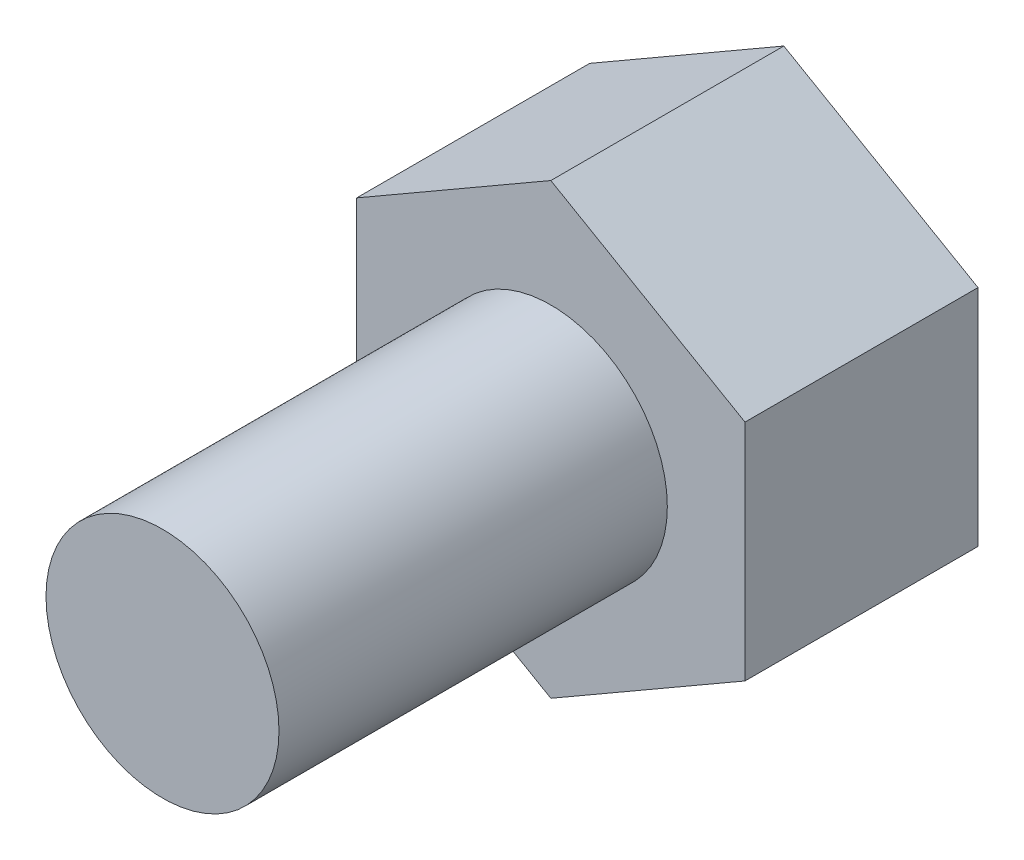
ISO-10303-21;
HEADER;
FILE_DESCRIPTION(('STEP AP214'),'2;1');
FILE_NAME('part.step','',(''),(''),'','','');
FILE_SCHEMA(('AUTOMOTIVE_DESIGN { 1 0 10303 214 1 1 1 1 }'));
ENDSEC;
DATA;
#1=APPLICATION_CONTEXT('core data for automotive mechanical design processes');
#2=APPLICATION_PROTOCOL_DEFINITION('international standard','automotive_design',2000,#1);
#3=PRODUCT_CONTEXT('',#1,'mechanical');
#4=PRODUCT('Part','Part','',(#3));
#5=PRODUCT_RELATED_PRODUCT_CATEGORY('part','',(#4));
#6=PRODUCT_DEFINITION_FORMATION('','',#4);
#7=PRODUCT_DEFINITION_CONTEXT('part definition',#1,'design');
#8=PRODUCT_DEFINITION('design','',#6,#7);
#9=PRODUCT_DEFINITION_SHAPE('','',#8);
#10=(LENGTH_UNIT() NAMED_UNIT(*) SI_UNIT(.MILLI.,.METRE.));
#11=(NAMED_UNIT(*) PLANE_ANGLE_UNIT() SI_UNIT($,.RADIAN.));
#12=(NAMED_UNIT(*) SI_UNIT($,.STERADIAN.) SOLID_ANGLE_UNIT());
#13=UNCERTAINTY_MEASURE_WITH_UNIT(LENGTH_MEASURE(1.E-05),#10,'distance_accuracy_value','');
#14=(GEOMETRIC_REPRESENTATION_CONTEXT(3) GLOBAL_UNCERTAINTY_ASSIGNED_CONTEXT((#13)) GLOBAL_UNIT_ASSIGNED_CONTEXT((#10,
#11,#12)) REPRESENTATION_CONTEXT('',''));
#15=CARTESIAN_POINT('',(0.,0.,0.));
#16=DIRECTION('',(0.,0.,1.));
#17=DIRECTION('',(1.,0.,0.));
#18=AXIS2_PLACEMENT_3D('',#15,#16,#17);
#19=CARTESIAN_POINT('',(-63.4947615904966,14.9787081339713,5.));
#20=DIRECTION('',(0.,0.,-1.));
#21=DIRECTION('',(-1.,0.,0.));
#22=AXIS2_PLACEMENT_3D('',#19,#20,#21);
#23=CYLINDRICAL_SURFACE('',#22,1.5);
#24=CARTESIAN_POINT('',(-63.4947615904966,14.9787081339713,5.));
#25=DIRECTION('',(0.,0.,1.));
#26=DIRECTION('',(1.,0.,0.));
#27=AXIS2_PLACEMENT_3D('',#24,#25,#26);
#28=CIRCLE('',#27,1.5);
#29=CARTESIAN_POINT('',(-61.9947615904966,14.9787081339713,5.));
#30=VERTEX_POINT('',#29);
#31=EDGE_CURVE('E11',#30,#30,#28,.T.);
#32=ORIENTED_EDGE('',*,*,#31,.F.);
#33=EDGE_LOOP('',(#32));
#34=FACE_BOUND('',#33,.T.);
#35=CARTESIAN_POINT('',(-63.4947615904966,14.9787081339713,0.));
#36=DIRECTION('',(0.,0.,-1.));
#37=DIRECTION('',(-1.,0.,0.));
#38=AXIS2_PLACEMENT_3D('',#35,#36,#37);
#39=CIRCLE('',#38,1.5);
#40=CARTESIAN_POINT('',(-64.9947615904966,14.9787081339713,0.));
#41=VERTEX_POINT('',#40);
#42=EDGE_CURVE('E41',#41,#41,#39,.T.);
#43=ORIENTED_EDGE('',*,*,#42,.F.);
#44=EDGE_LOOP('',(#43));
#45=FACE_BOUND('',#44,.T.);
#46=ADVANCED_FACE('F33',(#34,#45),#23,.T.);
#47=CARTESIAN_POINT('',(-63.4947615904966,14.9787081339713,5.));
#48=DIRECTION('',(0.,0.,1.));
#49=DIRECTION('',(1.,0.,0.));
#50=AXIS2_PLACEMENT_3D('',#47,#48,#49);
#51=PLANE('',#50);
#52=ORIENTED_EDGE('',*,*,#31,.T.);
#53=EDGE_LOOP('',(#52));
#54=FACE_BOUND('',#53,.T.);
#55=ADVANCED_FACE('F143',(#54),#51,.T.);
#56=CARTESIAN_POINT('',(-60.9947615904966,13.5353324609972,-3.));
#57=DIRECTION('',(-0.5,0.866025403784439,0.));
#58=DIRECTION('',(-0.866025403784439,-0.5,0.));
#59=AXIS2_PLACEMENT_3D('',#56,#57,#58);
#60=PLANE('',#59);
#61=DIRECTION('',(-0.866025403784439,-0.5,0.));
#62=VECTOR('',#61,1.);
#63=CARTESIAN_POINT('',(-60.9947615904966,13.5353324609972,0.));
#64=LINE('',#63,#62);
#65=CARTESIAN_POINT('',(-60.9947615904966,13.5353324609972,0.));
#66=VERTEX_POINT('',#65);
#67=CARTESIAN_POINT('',(-63.4947615904967,12.0919567880232,0.));
#68=VERTEX_POINT('',#67);
#69=EDGE_CURVE('E118',#66,#68,#64,.T.);
#70=ORIENTED_EDGE('',*,*,#69,.T.);
#71=DIRECTION('',(0.,0.,1.));
#72=VECTOR('',#71,1.);
#73=CARTESIAN_POINT('',(-63.4947615904967,12.0919567880232,-3.));
#74=LINE('',#73,#72);
#75=CARTESIAN_POINT('',(-63.4947615904967,12.0919567880232,-3.));
#76=VERTEX_POINT('',#75);
#77=EDGE_CURVE('E135',#76,#68,#74,.T.);
#78=ORIENTED_EDGE('',*,*,#77,.F.);
#79=DIRECTION('',(-0.866025403784439,-0.5,0.));
#80=VECTOR('',#79,1.);
#81=CARTESIAN_POINT('',(-60.9947615904966,13.5353324609972,-3.));
#82=LINE('',#81,#80);
#83=CARTESIAN_POINT('',(-60.9947615904966,13.5353324609972,-3.));
#84=VERTEX_POINT('',#83);
#85=EDGE_CURVE('E128',#84,#76,#82,.T.);
#86=ORIENTED_EDGE('',*,*,#85,.F.);
#87=DIRECTION('',(0.,0.,1.));
#88=VECTOR('',#87,1.);
#89=CARTESIAN_POINT('',(-60.9947615904966,13.5353324609972,-3.));
#90=LINE('',#89,#88);
#91=EDGE_CURVE('E114',#84,#66,#90,.T.);
#92=ORIENTED_EDGE('',*,*,#91,.T.);
#93=EDGE_LOOP('',(#70,#78,#86,#92));
#94=FACE_BOUND('',#93,.T.);
#95=ADVANCED_FACE('F148',(#94),#60,.F.);
#96=CARTESIAN_POINT('',(-63.4947615904967,12.0919567880232,-3.));
#97=DIRECTION('',(0.5,0.866025403784438,0.));
#98=DIRECTION('',(-0.866025403784438,0.5,0.));
#99=AXIS2_PLACEMENT_3D('',#96,#97,#98);
#100=PLANE('',#99);
#101=DIRECTION('',(-0.866025403784438,0.5,0.));
#102=VECTOR('',#101,1.);
#103=CARTESIAN_POINT('',(-63.4947615904967,12.0919567880232,0.));
#104=LINE('',#103,#102);
#105=CARTESIAN_POINT('',(-65.9947615904966,13.5353324609972,0.));
#106=VERTEX_POINT('',#105);
#107=EDGE_CURVE('E121',#68,#106,#104,.T.);
#108=ORIENTED_EDGE('',*,*,#107,.T.);
#109=DIRECTION('',(0.,0.,1.));
#110=VECTOR('',#109,1.);
#111=CARTESIAN_POINT('',(-65.9947615904966,13.5353324609972,-3.));
#112=LINE('',#111,#110);
#113=CARTESIAN_POINT('',(-65.9947615904966,13.5353324609972,-3.));
#114=VERTEX_POINT('',#113);
#115=EDGE_CURVE('E132',#114,#106,#112,.T.);
#116=ORIENTED_EDGE('',*,*,#115,.F.);
#117=DIRECTION('',(-0.866025403784438,0.5,0.));
#118=VECTOR('',#117,1.);
#119=CARTESIAN_POINT('',(-63.4947615904967,12.0919567880232,-3.));
#120=LINE('',#119,#118);
#121=EDGE_CURVE('E87',#76,#114,#120,.T.);
#122=ORIENTED_EDGE('',*,*,#121,.F.);
#123=ORIENTED_EDGE('',*,*,#77,.T.);
#124=EDGE_LOOP('',(#108,#116,#122,#123));
#125=FACE_BOUND('',#124,.T.);
#126=ADVANCED_FACE('F154',(#125),#100,.F.);
#127=CARTESIAN_POINT('',(-65.9947615904966,13.5353324609972,-3.));
#128=DIRECTION('',(1.,0.,0.));
#129=DIRECTION('',(0.,0.,-1.));
#130=AXIS2_PLACEMENT_3D('',#127,#128,#129);
#131=PLANE('',#130);
#132=DIRECTION('',(0.,1.,0.));
#133=VECTOR('',#132,1.);
#134=CARTESIAN_POINT('',(-65.9947615904966,13.5353324609972,0.));
#135=LINE('',#134,#133);
#136=CARTESIAN_POINT('',(-65.9947615904966,16.4220838069454,0.));
#137=VERTEX_POINT('',#136);
#138=EDGE_CURVE('E123',#106,#137,#135,.T.);
#139=ORIENTED_EDGE('',*,*,#138,.T.);
#140=DIRECTION('',(0.,0.,1.));
#141=VECTOR('',#140,1.);
#142=CARTESIAN_POINT('',(-65.9947615904966,16.4220838069454,-3.));
#143=LINE('',#142,#141);
#144=CARTESIAN_POINT('',(-65.9947615904966,16.4220838069454,-3.));
#145=VERTEX_POINT('',#144);
#146=EDGE_CURVE('E109',#145,#137,#143,.T.);
#147=ORIENTED_EDGE('',*,*,#146,.F.);
#148=DIRECTION('',(0.,1.,0.));
#149=VECTOR('',#148,1.);
#150=CARTESIAN_POINT('',(-65.9947615904966,13.5353324609972,-3.));
#151=LINE('',#150,#149);
#152=EDGE_CURVE('E100',#114,#145,#151,.T.);
#153=ORIENTED_EDGE('',*,*,#152,.F.);
#154=ORIENTED_EDGE('',*,*,#115,.T.);
#155=EDGE_LOOP('',(#139,#147,#153,#154));
#156=FACE_BOUND('',#155,.T.);
#157=ADVANCED_FACE('F160',(#156),#131,.F.);
#158=CARTESIAN_POINT('',(-65.9947615904966,16.4220838069454,-3.));
#159=DIRECTION('',(0.499999999999999,-0.866025403784439,0.));
#160=DIRECTION('',(0.866025403784439,0.499999999999999,0.));
#161=AXIS2_PLACEMENT_3D('',#158,#159,#160);
#162=PLANE('',#161);
#163=DIRECTION('',(0.866025403784439,0.499999999999999,0.));
#164=VECTOR('',#163,1.);
#165=CARTESIAN_POINT('',(-65.9947615904966,16.4220838069454,0.));
#166=LINE('',#165,#164);
#167=CARTESIAN_POINT('',(-63.4947615904966,17.8654594799194,0.));
#168=VERTEX_POINT('',#167);
#169=EDGE_CURVE('E108',#137,#168,#166,.T.);
#170=ORIENTED_EDGE('',*,*,#169,.T.);
#171=DIRECTION('',(0.,0.,1.));
#172=VECTOR('',#171,1.);
#173=CARTESIAN_POINT('',(-63.4947615904966,17.8654594799194,-3.));
#174=LINE('',#173,#172);
#175=CARTESIAN_POINT('',(-63.4947615904966,17.8654594799194,-3.));
#176=VERTEX_POINT('',#175);
#177=EDGE_CURVE('E105',#176,#168,#174,.T.);
#178=ORIENTED_EDGE('',*,*,#177,.F.);
#179=DIRECTION('',(0.866025403784439,0.499999999999999,0.));
#180=VECTOR('',#179,1.);
#181=CARTESIAN_POINT('',(-65.9947615904966,16.4220838069454,-3.));
#182=LINE('',#181,#180);
#183=EDGE_CURVE('E94',#145,#176,#182,.T.);
#184=ORIENTED_EDGE('',*,*,#183,.F.);
#185=ORIENTED_EDGE('',*,*,#146,.T.);
#186=EDGE_LOOP('',(#170,#178,#184,#185));
#187=FACE_BOUND('',#186,.T.);
#188=ADVANCED_FACE('F106',(#187),#162,.F.);
#189=CARTESIAN_POINT('',(-63.4947615904966,17.8654594799194,-3.));
#190=DIRECTION('',(-0.500000000000001,-0.866025403784438,0.));
#191=DIRECTION('',(0.866025403784438,-0.500000000000001,0.));
#192=AXIS2_PLACEMENT_3D('',#189,#190,#191);
#193=PLANE('',#192);
#194=DIRECTION('',(0.866025403784438,-0.500000000000001,0.));
#195=VECTOR('',#194,1.);
#196=CARTESIAN_POINT('',(-63.4947615904966,17.8654594799194,0.));
#197=LINE('',#196,#195);
#198=CARTESIAN_POINT('',(-60.9947615904966,16.4220838069454,0.));
#199=VERTEX_POINT('',#198);
#200=EDGE_CURVE('E72',#168,#199,#197,.T.);
#201=ORIENTED_EDGE('',*,*,#200,.T.);
#202=DIRECTION('',(0.,0.,1.));
#203=VECTOR('',#202,1.);
#204=CARTESIAN_POINT('',(-60.9947615904966,16.4220838069454,-3.));
#205=LINE('',#204,#203);
#206=CARTESIAN_POINT('',(-60.9947615904966,16.4220838069454,-3.));
#207=VERTEX_POINT('',#206);
#208=EDGE_CURVE('E110',#207,#199,#205,.T.);
#209=ORIENTED_EDGE('',*,*,#208,.F.);
#210=DIRECTION('',(0.866025403784438,-0.500000000000001,0.));
#211=VECTOR('',#210,1.);
#212=CARTESIAN_POINT('',(-63.4947615904966,17.8654594799194,-3.));
#213=LINE('',#212,#211);
#214=EDGE_CURVE('E98',#176,#207,#213,.T.);
#215=ORIENTED_EDGE('',*,*,#214,.F.);
#216=ORIENTED_EDGE('',*,*,#177,.T.);
#217=EDGE_LOOP('',(#201,#209,#215,#216));
#218=FACE_BOUND('',#217,.T.);
#219=ADVANCED_FACE('F112',(#218),#193,.F.);
#220=CARTESIAN_POINT('',(-60.9947615904966,16.4220838069454,-3.));
#221=DIRECTION('',(-1.,0.,0.));
#222=DIRECTION('',(0.,0.,1.));
#223=AXIS2_PLACEMENT_3D('',#220,#221,#222);
#224=PLANE('',#223);
#225=DIRECTION('',(0.,-1.,0.));
#226=VECTOR('',#225,1.);
#227=CARTESIAN_POINT('',(-60.9947615904966,16.4220838069454,0.));
#228=LINE('',#227,#226);
#229=EDGE_CURVE('E78',#199,#66,#228,.T.);
#230=ORIENTED_EDGE('',*,*,#229,.T.);
#231=ORIENTED_EDGE('',*,*,#91,.F.);
#232=DIRECTION('',(0.,-1.,0.));
#233=VECTOR('',#232,1.);
#234=CARTESIAN_POINT('',(-60.9947615904966,16.4220838069454,-3.));
#235=LINE('',#234,#233);
#236=EDGE_CURVE('E49',#207,#84,#235,.T.);
#237=ORIENTED_EDGE('',*,*,#236,.F.);
#238=ORIENTED_EDGE('',*,*,#208,.T.);
#239=EDGE_LOOP('',(#230,#231,#237,#238));
#240=FACE_BOUND('',#239,.T.);
#241=ADVANCED_FACE('F168',(#240),#224,.F.);
#242=CARTESIAN_POINT('',(0.,0.,-3.));
#243=DIRECTION('',(0.,0.,-1.));
#244=DIRECTION('',(-1.,0.,0.));
#245=AXIS2_PLACEMENT_3D('',#242,#243,#244);
#246=PLANE('',#245);
#247=ORIENTED_EDGE('',*,*,#85,.T.);
#248=ORIENTED_EDGE('',*,*,#121,.T.);
#249=ORIENTED_EDGE('',*,*,#152,.T.);
#250=ORIENTED_EDGE('',*,*,#183,.T.);
#251=ORIENTED_EDGE('',*,*,#214,.T.);
#252=ORIENTED_EDGE('',*,*,#236,.T.);
#253=EDGE_LOOP('',(#247,#248,#249,#250,#251,#252));
#254=FACE_BOUND('',#253,.T.);
#255=ADVANCED_FACE('F96',(#254),#246,.T.);
#256=CARTESIAN_POINT('',(0.,0.,0.));
#257=DIRECTION('',(0.,0.,-1.));
#258=DIRECTION('',(-1.,0.,0.));
#259=AXIS2_PLACEMENT_3D('',#256,#257,#258);
#260=PLANE('',#259);
#261=ORIENTED_EDGE('',*,*,#42,.T.);
#262=EDGE_LOOP('',(#261));
#263=FACE_BOUND('',#262,.T.);
#264=ORIENTED_EDGE('',*,*,#69,.F.);
#265=ORIENTED_EDGE('',*,*,#229,.F.);
#266=ORIENTED_EDGE('',*,*,#200,.F.);
#267=ORIENTED_EDGE('',*,*,#169,.F.);
#268=ORIENTED_EDGE('',*,*,#138,.F.);
#269=ORIENTED_EDGE('',*,*,#107,.F.);
#270=EDGE_LOOP('',(#264,#265,#266,#267,#268,#269));
#271=FACE_BOUND('',#270,.T.);
#272=ADVANCED_FACE('F139',(#263,#271),#260,.F.);
#273=CLOSED_SHELL('',(#46,#55,#95,#126,#157,#188,#219,#241,#255,#272));
#274=MANIFOLD_SOLID_BREP('B2',#273);
#275=ADVANCED_BREP_SHAPE_REPRESENTATION('',(#18,#274),#14);
#276=SHAPE_DEFINITION_REPRESENTATION(#9,#275);
ENDSEC;
END-ISO-10303-21;
